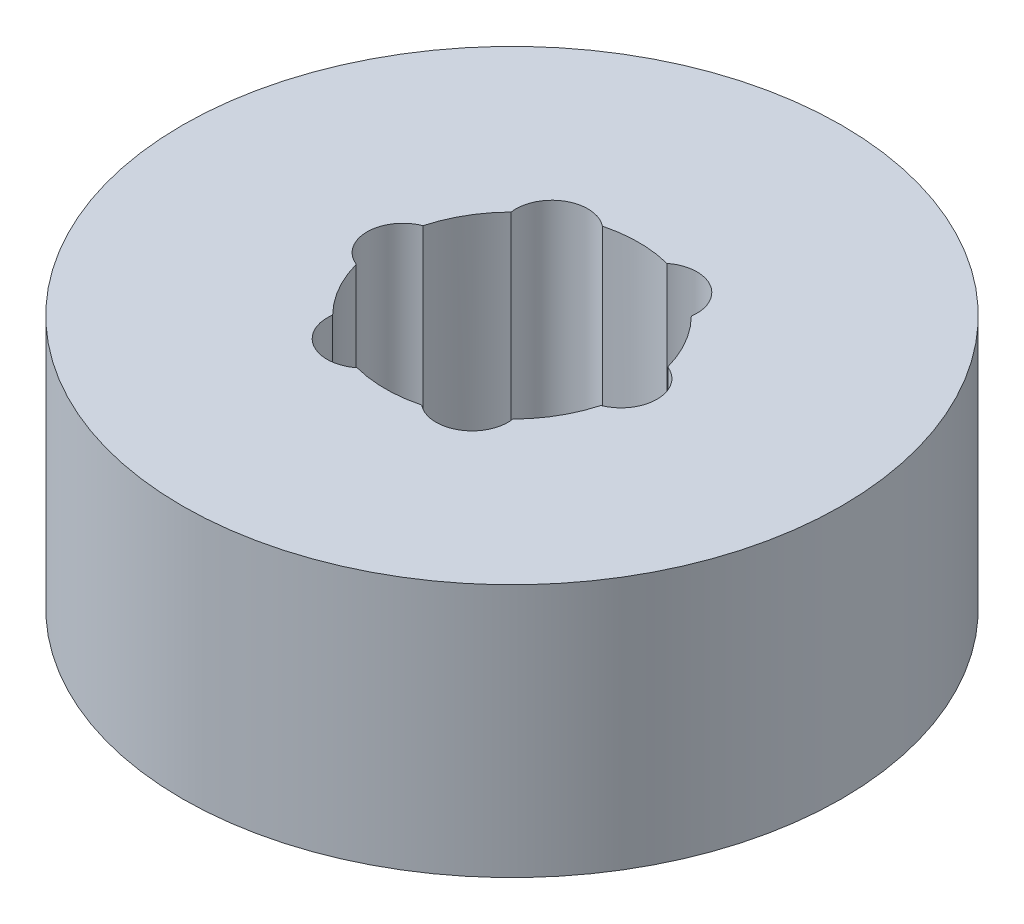
ISO-10303-21;
HEADER;
FILE_DESCRIPTION(('STEP AP214'),'2;1');
FILE_NAME('part.step','',(''),(''),'','','');
FILE_SCHEMA(('AUTOMOTIVE_DESIGN { 1 0 10303 214 1 1 1 1 }'));
ENDSEC;
DATA;
#1=APPLICATION_CONTEXT('core data for automotive mechanical design processes');
#2=APPLICATION_PROTOCOL_DEFINITION('international standard','automotive_design',2000,#1);
#3=PRODUCT_CONTEXT('',#1,'mechanical');
#4=PRODUCT('Part','Part','',(#3));
#5=PRODUCT_RELATED_PRODUCT_CATEGORY('part','',(#4));
#6=PRODUCT_DEFINITION_FORMATION('','',#4);
#7=PRODUCT_DEFINITION_CONTEXT('part definition',#1,'design');
#8=PRODUCT_DEFINITION('design','',#6,#7);
#9=PRODUCT_DEFINITION_SHAPE('','',#8);
#10=(LENGTH_UNIT() NAMED_UNIT(*) SI_UNIT(.MILLI.,.METRE.));
#11=(NAMED_UNIT(*) PLANE_ANGLE_UNIT() SI_UNIT($,.RADIAN.));
#12=(NAMED_UNIT(*) SI_UNIT($,.STERADIAN.) SOLID_ANGLE_UNIT());
#13=UNCERTAINTY_MEASURE_WITH_UNIT(LENGTH_MEASURE(1.E-05),#10,'distance_accuracy_value','');
#14=(GEOMETRIC_REPRESENTATION_CONTEXT(3) GLOBAL_UNCERTAINTY_ASSIGNED_CONTEXT((#13)) GLOBAL_UNIT_ASSIGNED_CONTEXT((#10,
#11,#12)) REPRESENTATION_CONTEXT('',''));
#15=CARTESIAN_POINT('',(0.,0.,0.));
#16=DIRECTION('',(0.,0.,1.));
#17=DIRECTION('',(1.,0.,0.));
#18=AXIS2_PLACEMENT_3D('',#15,#16,#17);
#19=CARTESIAN_POINT('',(0.,25.,0.));
#20=DIRECTION('',(0.,-1.,0.));
#21=DIRECTION('',(0.,0.,-1.));
#22=AXIS2_PLACEMENT_3D('',#19,#20,#21);
#23=CYLINDRICAL_SURFACE('',#22,32.5);
#24=CARTESIAN_POINT('',(0.,25.,0.));
#25=DIRECTION('',(0.,1.,0.));
#26=DIRECTION('',(0.,0.,1.));
#27=AXIS2_PLACEMENT_3D('',#24,#25,#26);
#28=CIRCLE('',#27,32.5);
#29=CARTESIAN_POINT('',(0.,25.,32.5));
#30=VERTEX_POINT('',#29);
#31=EDGE_CURVE('E162',#30,#30,#28,.T.);
#32=ORIENTED_EDGE('',*,*,#31,.F.);
#33=EDGE_LOOP('',(#32));
#34=FACE_BOUND('',#33,.T.);
#35=CARTESIAN_POINT('',(0.,0.,0.));
#36=DIRECTION('',(0.,1.,0.));
#37=DIRECTION('',(0.,0.,1.));
#38=AXIS2_PLACEMENT_3D('',#35,#36,#37);
#39=CIRCLE('',#38,32.5);
#40=CARTESIAN_POINT('',(0.,0.,32.5));
#41=VERTEX_POINT('',#40);
#42=EDGE_CURVE('E157',#41,#41,#39,.T.);
#43=ORIENTED_EDGE('',*,*,#42,.T.);
#44=EDGE_LOOP('',(#43));
#45=FACE_BOUND('',#44,.T.);
#46=ADVANCED_FACE('F39',(#34,#45),#23,.T.);
#47=CARTESIAN_POINT('',(0.,25.,0.));
#48=DIRECTION('',(0.,1.,0.));
#49=DIRECTION('',(0.,0.,1.));
#50=AXIS2_PLACEMENT_3D('',#47,#48,#49);
#51=PLANE('',#50);
#52=CARTESIAN_POINT('',(-5.37489814532669,25.,-9.3095966732133));
#53=DIRECTION('',(0.,1.,0.));
#54=DIRECTION('',(-0.866025403784433,0.,0.50000000000001));
#55=AXIS2_PLACEMENT_3D('',#52,#53,#54);
#56=CIRCLE('',#55,3.54547337180228);
#57=CARTESIAN_POINT('',(-3.17501813949648,25.,-12.0900479657389));
#58=VERTEX_POINT('',#57);
#59=CARTESIAN_POINT('',(-8.88277960155427,25.,-8.79467034914961));
#60=VERTEX_POINT('',#59);
#61=EDGE_CURVE('E218',#58,#60,#56,.T.);
#62=ORIENTED_EDGE('',*,*,#61,.F.);
#63=CARTESIAN_POINT('',(0.,25.,0.));
#64=DIRECTION('',(0.,1.,0.));
#65=DIRECTION('',(0.,0.,1.));
#66=AXIS2_PLACEMENT_3D('',#63,#64,#65);
#67=CIRCLE('',#66,12.5);
#68=CARTESIAN_POINT('',(3.17501813949622,25.,-12.090047965739));
#69=VERTEX_POINT('',#68);
#70=EDGE_CURVE('E169',#69,#58,#67,.T.);
#71=ORIENTED_EDGE('',*,*,#70,.F.);
#72=CARTESIAN_POINT('',(5.37489814532649,25.,-9.30959667321341));
#73=DIRECTION('',(0.,1.,0.));
#74=DIRECTION('',(-0.866025403784443,0.,-0.499999999999992));
#75=AXIS2_PLACEMENT_3D('',#72,#73,#74);
#76=CIRCLE('',#75,3.54547337180228);
#77=CARTESIAN_POINT('',(8.88277960155408,25.,-8.7946703491498));
#78=VERTEX_POINT('',#77);
#79=EDGE_CURVE('E285',#78,#69,#76,.T.);
#80=ORIENTED_EDGE('',*,*,#79,.F.);
#81=CARTESIAN_POINT('',(12.0577977410505,25.,-3.29537761658926));
#82=VERTEX_POINT('',#81);
#83=EDGE_CURVE('E174',#82,#78,#67,.T.);
#84=ORIENTED_EDGE('',*,*,#83,.F.);
#85=CARTESIAN_POINT('',(10.7497962906532,25.,0.));
#86=DIRECTION('',(0.,1.,0.));
#87=DIRECTION('',(0.,0.,-1.));
#88=AXIS2_PLACEMENT_3D('',#85,#86,#87);
#89=CIRCLE('',#88,3.54547337180228);
#90=CARTESIAN_POINT('',(12.0577977410505,25.,3.29537761658926));
#91=VERTEX_POINT('',#90);
#92=EDGE_CURVE('E280',#91,#82,#89,.T.);
#93=ORIENTED_EDGE('',*,*,#92,.F.);
#94=CARTESIAN_POINT('',(8.88277960155421,25.,8.79467034914968));
#95=VERTEX_POINT('',#94);
#96=EDGE_CURVE('E164',#95,#91,#67,.T.);
#97=ORIENTED_EDGE('',*,*,#96,.F.);
#98=CARTESIAN_POINT('',(5.37489814532662,25.,9.30959667321334));
#99=DIRECTION('',(0.,1.,0.));
#100=DIRECTION('',(0.866025403784436,0.,-0.500000000000004));
#101=AXIS2_PLACEMENT_3D('',#98,#99,#100);
#102=CIRCLE('',#101,3.54547337180228);
#103=CARTESIAN_POINT('',(3.17501813949639,25.,12.090047965739));
#104=VERTEX_POINT('',#103);
#105=EDGE_CURVE('E269',#104,#95,#102,.T.);
#106=ORIENTED_EDGE('',*,*,#105,.F.);
#107=CARTESIAN_POINT('',(-3.17501813949631,25.,12.090047965739));
#108=VERTEX_POINT('',#107);
#109=EDGE_CURVE('E149',#108,#104,#67,.T.);
#110=ORIENTED_EDGE('',*,*,#109,.F.);
#111=CARTESIAN_POINT('',(-5.37489814532656,25.,9.30959667321337));
#112=DIRECTION('',(0.,1.,0.));
#113=DIRECTION('',(0.86602540378444,0.,0.499999999999998));
#114=AXIS2_PLACEMENT_3D('',#111,#112,#113);
#115=CIRCLE('',#114,3.54547337180228);
#116=CARTESIAN_POINT('',(-8.88277960155414,25.,8.79467034914974));
#117=VERTEX_POINT('',#116);
#118=EDGE_CURVE('E128',#117,#108,#115,.T.);
#119=ORIENTED_EDGE('',*,*,#118,.F.);
#120=CARTESIAN_POINT('',(-12.0577977410505,25.,3.29537761658926));
#121=VERTEX_POINT('',#120);
#122=EDGE_CURVE('E148',#121,#117,#67,.T.);
#123=ORIENTED_EDGE('',*,*,#122,.F.);
#124=CARTESIAN_POINT('',(-10.7497962906532,25.,0.));
#125=DIRECTION('',(0.,1.,0.));
#126=DIRECTION('',(0.,0.,1.));
#127=AXIS2_PLACEMENT_3D('',#124,#125,#126);
#128=CIRCLE('',#127,3.54547337180228);
#129=CARTESIAN_POINT('',(-12.0577977410505,25.,-3.29537761658926));
#130=VERTEX_POINT('',#129);
#131=EDGE_CURVE('E179',#130,#121,#128,.T.);
#132=ORIENTED_EDGE('',*,*,#131,.F.);
#133=EDGE_CURVE('E161',#60,#130,#67,.T.);
#134=ORIENTED_EDGE('',*,*,#133,.F.);
#135=EDGE_LOOP('',(#62,#71,#80,#84,#93,#97,#106,#110,#119,#123,#132,#134));
#136=FACE_BOUND('',#135,.T.);
#137=ORIENTED_EDGE('',*,*,#31,.T.);
#138=EDGE_LOOP('',(#137));
#139=FACE_BOUND('',#138,.T.);
#140=ADVANCED_FACE('F141',(#136,#139),#51,.T.);
#141=CARTESIAN_POINT('',(0.,0.,0.));
#142=DIRECTION('',(0.,1.,0.));
#143=DIRECTION('',(0.,0.,1.));
#144=AXIS2_PLACEMENT_3D('',#141,#142,#143);
#145=PLANE('',#144);
#146=CARTESIAN_POINT('',(0.,0.,0.));
#147=DIRECTION('',(0.,1.,0.));
#148=DIRECTION('',(0.,0.,1.));
#149=AXIS2_PLACEMENT_3D('',#146,#147,#148);
#150=CIRCLE('',#149,12.5);
#151=CARTESIAN_POINT('',(0.,0.,12.5));
#152=VERTEX_POINT('',#151);
#153=EDGE_CURVE('E166',#152,#152,#150,.T.);
#154=ORIENTED_EDGE('',*,*,#153,.T.);
#155=EDGE_LOOP('',(#154));
#156=FACE_BOUND('',#155,.T.);
#157=ORIENTED_EDGE('',*,*,#42,.F.);
#158=EDGE_LOOP('',(#157));
#159=FACE_BOUND('',#158,.T.);
#160=ADVANCED_FACE('F234',(#156,#159),#145,.F.);
#161=CARTESIAN_POINT('',(0.,25.,0.));
#162=DIRECTION('',(0.,-1.,0.));
#163=DIRECTION('',(0.,0.,-1.));
#164=AXIS2_PLACEMENT_3D('',#161,#162,#163);
#165=CYLINDRICAL_SURFACE('',#164,12.5);
#166=DIRECTION('',(0.,1.,0.));
#167=VECTOR('',#166,1.);
#168=CARTESIAN_POINT('',(-3.17501813949647,15.3963991362043,-12.0900479657389));
#169=LINE('',#168,#167);
#170=CARTESIAN_POINT('',(-3.17501813949648,5.79279827240867,-12.0900479657389));
#171=VERTEX_POINT('',#170);
#172=EDGE_CURVE('E11',#171,#58,#169,.T.);
#173=ORIENTED_EDGE('',*,*,#172,.F.);
#174=CARTESIAN_POINT('',(0.,5.79279827240867,0.));
#175=DIRECTION('',(0.,1.,0.));
#176=DIRECTION('',(0.,0.,1.));
#177=AXIS2_PLACEMENT_3D('',#174,#175,#176);
#178=CIRCLE('',#177,12.5);
#179=CARTESIAN_POINT('',(-8.88277960155427,5.79279827240867,-8.79467034914961));
#180=VERTEX_POINT('',#179);
#181=EDGE_CURVE('E214',#171,#180,#178,.T.);
#182=ORIENTED_EDGE('',*,*,#181,.T.);
#183=DIRECTION('',(0.,1.,0.));
#184=VECTOR('',#183,1.);
#185=CARTESIAN_POINT('',(-8.88277960155427,15.3963991362043,-8.79467034914961));
#186=LINE('',#185,#184);
#187=EDGE_CURVE('E46',#60,#180,#186,.F.);
#188=ORIENTED_EDGE('',*,*,#187,.F.);
#189=ORIENTED_EDGE('',*,*,#133,.T.);
#190=DIRECTION('',(0.,1.,0.));
#191=VECTOR('',#190,1.);
#192=CARTESIAN_POINT('',(-12.0577977410505,15.3963991362043,-3.29537761658926));
#193=LINE('',#192,#191);
#194=CARTESIAN_POINT('',(-12.0577977410505,5.79279827240867,-3.29537761658926));
#195=VERTEX_POINT('',#194);
#196=EDGE_CURVE('E187',#195,#130,#193,.T.);
#197=ORIENTED_EDGE('',*,*,#196,.F.);
#198=CARTESIAN_POINT('',(0.,5.79279827240867,0.));
#199=DIRECTION('',(0.,1.,0.));
#200=DIRECTION('',(0.,0.,1.));
#201=AXIS2_PLACEMENT_3D('',#198,#199,#200);
#202=CIRCLE('',#201,12.5);
#203=CARTESIAN_POINT('',(-12.0577977410505,5.79279827240867,3.29537761658926));
#204=VERTEX_POINT('',#203);
#205=EDGE_CURVE('E184',#195,#204,#202,.T.);
#206=ORIENTED_EDGE('',*,*,#205,.T.);
#207=DIRECTION('',(0.,1.,0.));
#208=VECTOR('',#207,1.);
#209=CARTESIAN_POINT('',(-12.0577977410505,15.3963991362043,3.29537761658926));
#210=LINE('',#209,#208);
#211=EDGE_CURVE('E158',#121,#204,#210,.F.);
#212=ORIENTED_EDGE('',*,*,#211,.F.);
#213=ORIENTED_EDGE('',*,*,#122,.T.);
#214=DIRECTION('',(0.,1.,0.));
#215=VECTOR('',#214,1.);
#216=CARTESIAN_POINT('',(-8.88277960155414,15.3963991362043,8.79467034914974));
#217=LINE('',#216,#215);
#218=CARTESIAN_POINT('',(-8.88277960155414,5.79279827240867,8.79467034914974));
#219=VERTEX_POINT('',#218);
#220=EDGE_CURVE('E127',#219,#117,#217,.T.);
#221=ORIENTED_EDGE('',*,*,#220,.F.);
#222=CARTESIAN_POINT('',(0.,5.79279827240867,0.));
#223=DIRECTION('',(0.,1.,0.));
#224=DIRECTION('',(0.,0.,1.));
#225=AXIS2_PLACEMENT_3D('',#222,#223,#224);
#226=CIRCLE('',#225,12.5);
#227=CARTESIAN_POINT('',(-3.17501813949631,5.79279827240867,12.090047965739));
#228=VERTEX_POINT('',#227);
#229=EDGE_CURVE('E189',#219,#228,#226,.T.);
#230=ORIENTED_EDGE('',*,*,#229,.T.);
#231=DIRECTION('',(0.,1.,0.));
#232=VECTOR('',#231,1.);
#233=CARTESIAN_POINT('',(-3.1750181394963,15.3963991362043,12.090047965739));
#234=LINE('',#233,#232);
#235=EDGE_CURVE('E140',#108,#228,#234,.F.);
#236=ORIENTED_EDGE('',*,*,#235,.F.);
#237=ORIENTED_EDGE('',*,*,#109,.T.);
#238=DIRECTION('',(0.,1.,0.));
#239=VECTOR('',#238,1.);
#240=CARTESIAN_POINT('',(3.17501813949639,15.3963991362043,12.090047965739));
#241=LINE('',#240,#239);
#242=CARTESIAN_POINT('',(3.17501813949639,5.79279827240867,12.090047965739));
#243=VERTEX_POINT('',#242);
#244=EDGE_CURVE('E196',#243,#104,#241,.T.);
#245=ORIENTED_EDGE('',*,*,#244,.F.);
#246=CARTESIAN_POINT('',(0.,5.79279827240867,0.));
#247=DIRECTION('',(0.,1.,0.));
#248=DIRECTION('',(0.,0.,1.));
#249=AXIS2_PLACEMENT_3D('',#246,#247,#248);
#250=CIRCLE('',#249,12.5);
#251=CARTESIAN_POINT('',(8.88277960155421,5.79279827240867,8.79467034914968));
#252=VERTEX_POINT('',#251);
#253=EDGE_CURVE('E136',#243,#252,#250,.T.);
#254=ORIENTED_EDGE('',*,*,#253,.T.);
#255=DIRECTION('',(0.,1.,0.));
#256=VECTOR('',#255,1.);
#257=CARTESIAN_POINT('',(8.8827796015542,15.3963991362043,8.79467034914967));
#258=LINE('',#257,#256);
#259=EDGE_CURVE('E194',#95,#252,#258,.F.);
#260=ORIENTED_EDGE('',*,*,#259,.F.);
#261=ORIENTED_EDGE('',*,*,#96,.T.);
#262=DIRECTION('',(0.,1.,0.));
#263=VECTOR('',#262,1.);
#264=CARTESIAN_POINT('',(12.0577977410505,15.3963991362043,3.29537761658926));
#265=LINE('',#264,#263);
#266=CARTESIAN_POINT('',(12.0577977410505,5.79279827240867,3.29537761658926));
#267=VERTEX_POINT('',#266);
#268=EDGE_CURVE('E206',#267,#91,#265,.T.);
#269=ORIENTED_EDGE('',*,*,#268,.F.);
#270=CARTESIAN_POINT('',(0.,5.79279827240867,0.));
#271=DIRECTION('',(0.,1.,0.));
#272=DIRECTION('',(0.,0.,1.));
#273=AXIS2_PLACEMENT_3D('',#270,#271,#272);
#274=CIRCLE('',#273,12.5);
#275=CARTESIAN_POINT('',(12.0577977410505,5.79279827240867,-3.29537761658926));
#276=VERTEX_POINT('',#275);
#277=EDGE_CURVE('E199',#267,#276,#274,.T.);
#278=ORIENTED_EDGE('',*,*,#277,.T.);
#279=DIRECTION('',(0.,1.,0.));
#280=VECTOR('',#279,1.);
#281=CARTESIAN_POINT('',(12.0577977410505,15.3963991362043,-3.29537761658926));
#282=LINE('',#281,#280);
#283=EDGE_CURVE('E201',#82,#276,#282,.F.);
#284=ORIENTED_EDGE('',*,*,#283,.F.);
#285=ORIENTED_EDGE('',*,*,#83,.T.);
#286=DIRECTION('',(0.,1.,0.));
#287=VECTOR('',#286,1.);
#288=CARTESIAN_POINT('',(8.88277960155408,15.3963991362043,-8.7946703491498));
#289=LINE('',#288,#287);
#290=CARTESIAN_POINT('',(8.88277960155408,5.79279827240867,-8.7946703491498));
#291=VERTEX_POINT('',#290);
#292=EDGE_CURVE('E213',#291,#78,#289,.T.);
#293=ORIENTED_EDGE('',*,*,#292,.F.);
#294=CARTESIAN_POINT('',(0.,5.79279827240867,0.));
#295=DIRECTION('',(0.,1.,0.));
#296=DIRECTION('',(0.,0.,1.));
#297=AXIS2_PLACEMENT_3D('',#294,#295,#296);
#298=CIRCLE('',#297,12.5);
#299=CARTESIAN_POINT('',(3.17501813949622,5.79279827240867,-12.090047965739));
#300=VERTEX_POINT('',#299);
#301=EDGE_CURVE('E208',#291,#300,#298,.T.);
#302=ORIENTED_EDGE('',*,*,#301,.T.);
#303=DIRECTION('',(0.,1.,0.));
#304=VECTOR('',#303,1.);
#305=CARTESIAN_POINT('',(3.17501813949622,15.3963991362043,-12.090047965739));
#306=LINE('',#305,#304);
#307=EDGE_CURVE('E211',#69,#300,#306,.F.);
#308=ORIENTED_EDGE('',*,*,#307,.F.);
#309=ORIENTED_EDGE('',*,*,#70,.T.);
#310=EDGE_LOOP('',(#173,#182,#188,#189,#197,#206,#212,#213,#221,#230,#236,#237,#245,#254,#260,
#261,#269,#278,#284,#285,#293,#302,#308,#309));
#311=FACE_BOUND('',#310,.T.);
#312=ORIENTED_EDGE('',*,*,#153,.F.);
#313=EDGE_LOOP('',(#312));
#314=FACE_BOUND('',#313,.T.);
#315=ADVANCED_FACE('F152',(#311,#314),#165,.F.);
#316=CARTESIAN_POINT('',(-10.7497962906532,5.79279827240867,0.));
#317=DIRECTION('',(0.,1.,0.));
#318=DIRECTION('',(0.,0.,1.));
#319=AXIS2_PLACEMENT_3D('',#316,#317,#318);
#320=CYLINDRICAL_SURFACE('',#319,3.54547337180228);
#321=ORIENTED_EDGE('',*,*,#196,.T.);
#322=ORIENTED_EDGE('',*,*,#131,.T.);
#323=ORIENTED_EDGE('',*,*,#211,.T.);
#324=CARTESIAN_POINT('',(-10.7497962906532,5.79279827240867,0.));
#325=DIRECTION('',(0.,1.,0.));
#326=DIRECTION('',(0.,0.,1.));
#327=AXIS2_PLACEMENT_3D('',#324,#325,#326);
#328=CIRCLE('',#327,3.54547337180228);
#329=EDGE_CURVE('E180',#195,#204,#328,.T.);
#330=ORIENTED_EDGE('',*,*,#329,.F.);
#331=EDGE_LOOP('',(#321,#322,#323,#330));
#332=FACE_BOUND('',#331,.T.);
#333=ADVANCED_FACE('F244',(#332),#320,.F.);
#334=CARTESIAN_POINT('',(-10.7497962906532,5.79279827240867,0.));
#335=DIRECTION('',(0.,1.,0.));
#336=DIRECTION('',(0.,0.,1.));
#337=AXIS2_PLACEMENT_3D('',#334,#335,#336);
#338=PLANE('',#337);
#339=ORIENTED_EDGE('',*,*,#329,.T.);
#340=ORIENTED_EDGE('',*,*,#205,.F.);
#341=EDGE_LOOP('',(#339,#340));
#342=FACE_BOUND('',#341,.T.);
#343=ADVANCED_FACE('F248',(#342),#338,.T.);
#344=CARTESIAN_POINT('',(-5.37489814532656,5.79279827240867,9.30959667321337));
#345=DIRECTION('',(0.,1.,0.));
#346=DIRECTION('',(0.,0.,1.));
#347=AXIS2_PLACEMENT_3D('',#344,#345,#346);
#348=CYLINDRICAL_SURFACE('',#347,3.54547337180228);
#349=ORIENTED_EDGE('',*,*,#220,.T.);
#350=ORIENTED_EDGE('',*,*,#118,.T.);
#351=ORIENTED_EDGE('',*,*,#235,.T.);
#352=CARTESIAN_POINT('',(-5.37489814532656,5.79279827240867,9.30959667321337));
#353=DIRECTION('',(0.,1.,0.));
#354=DIRECTION('',(0.86602540378444,0.,0.499999999999998));
#355=AXIS2_PLACEMENT_3D('',#352,#353,#354);
#356=CIRCLE('',#355,3.54547337180228);
#357=EDGE_CURVE('E135',#219,#228,#356,.T.);
#358=ORIENTED_EDGE('',*,*,#357,.F.);
#359=EDGE_LOOP('',(#349,#350,#351,#358));
#360=FACE_BOUND('',#359,.T.);
#361=ADVANCED_FACE('F126',(#360),#348,.F.);
#362=CARTESIAN_POINT('',(-5.37489814532656,5.79279827240867,9.30959667321337));
#363=DIRECTION('',(0.,1.,0.));
#364=DIRECTION('',(0.86602540378444,0.,0.499999999999998));
#365=AXIS2_PLACEMENT_3D('',#362,#363,#364);
#366=PLANE('',#365);
#367=ORIENTED_EDGE('',*,*,#357,.T.);
#368=ORIENTED_EDGE('',*,*,#229,.F.);
#369=EDGE_LOOP('',(#367,#368));
#370=FACE_BOUND('',#369,.T.);
#371=ADVANCED_FACE('F258',(#370),#366,.T.);
#372=CARTESIAN_POINT('',(5.37489814532662,5.79279827240867,9.30959667321334));
#373=DIRECTION('',(0.,1.,0.));
#374=DIRECTION('',(0.,0.,1.));
#375=AXIS2_PLACEMENT_3D('',#372,#373,#374);
#376=CYLINDRICAL_SURFACE('',#375,3.54547337180228);
#377=ORIENTED_EDGE('',*,*,#244,.T.);
#378=ORIENTED_EDGE('',*,*,#105,.T.);
#379=ORIENTED_EDGE('',*,*,#259,.T.);
#380=CARTESIAN_POINT('',(5.37489814532662,5.79279827240867,9.30959667321334));
#381=DIRECTION('',(0.,1.,0.));
#382=DIRECTION('',(0.866025403784436,0.,-0.500000000000004));
#383=AXIS2_PLACEMENT_3D('',#380,#381,#382);
#384=CIRCLE('',#383,3.54547337180228);
#385=EDGE_CURVE('E147',#243,#252,#384,.T.);
#386=ORIENTED_EDGE('',*,*,#385,.F.);
#387=EDGE_LOOP('',(#377,#378,#379,#386));
#388=FACE_BOUND('',#387,.T.);
#389=ADVANCED_FACE('F256',(#388),#376,.F.);
#390=CARTESIAN_POINT('',(5.37489814532662,5.79279827240867,9.30959667321334));
#391=DIRECTION('',(0.,1.,0.));
#392=DIRECTION('',(0.866025403784436,0.,-0.500000000000004));
#393=AXIS2_PLACEMENT_3D('',#390,#391,#392);
#394=PLANE('',#393);
#395=ORIENTED_EDGE('',*,*,#385,.T.);
#396=ORIENTED_EDGE('',*,*,#253,.F.);
#397=EDGE_LOOP('',(#395,#396));
#398=FACE_BOUND('',#397,.T.);
#399=ADVANCED_FACE('F263',(#398),#394,.T.);
#400=CARTESIAN_POINT('',(10.7497962906532,5.79279827240867,0.));
#401=DIRECTION('',(0.,1.,0.));
#402=DIRECTION('',(0.,0.,1.));
#403=AXIS2_PLACEMENT_3D('',#400,#401,#402);
#404=CYLINDRICAL_SURFACE('',#403,3.54547337180228);
#405=ORIENTED_EDGE('',*,*,#268,.T.);
#406=ORIENTED_EDGE('',*,*,#92,.T.);
#407=ORIENTED_EDGE('',*,*,#283,.T.);
#408=CARTESIAN_POINT('',(10.7497962906532,5.79279827240867,0.));
#409=DIRECTION('',(0.,1.,0.));
#410=DIRECTION('',(0.,0.,-1.));
#411=AXIS2_PLACEMENT_3D('',#408,#409,#410);
#412=CIRCLE('',#411,3.54547337180228);
#413=EDGE_CURVE('E273',#267,#276,#412,.T.);
#414=ORIENTED_EDGE('',*,*,#413,.F.);
#415=EDGE_LOOP('',(#405,#406,#407,#414));
#416=FACE_BOUND('',#415,.T.);
#417=ADVANCED_FACE('F297',(#416),#404,.F.);
#418=CARTESIAN_POINT('',(10.7497962906532,5.79279827240867,0.));
#419=DIRECTION('',(0.,1.,0.));
#420=DIRECTION('',(0.,0.,-1.));
#421=AXIS2_PLACEMENT_3D('',#418,#419,#420);
#422=PLANE('',#421);
#423=ORIENTED_EDGE('',*,*,#413,.T.);
#424=ORIENTED_EDGE('',*,*,#277,.F.);
#425=EDGE_LOOP('',(#423,#424));
#426=FACE_BOUND('',#425,.T.);
#427=ADVANCED_FACE('F299',(#426),#422,.T.);
#428=CARTESIAN_POINT('',(5.37489814532649,5.79279827240867,-9.30959667321341));
#429=DIRECTION('',(0.,1.,0.));
#430=DIRECTION('',(0.,0.,1.));
#431=AXIS2_PLACEMENT_3D('',#428,#429,#430);
#432=CYLINDRICAL_SURFACE('',#431,3.54547337180228);
#433=ORIENTED_EDGE('',*,*,#292,.T.);
#434=ORIENTED_EDGE('',*,*,#79,.T.);
#435=ORIENTED_EDGE('',*,*,#307,.T.);
#436=CARTESIAN_POINT('',(5.37489814532649,5.79279827240867,-9.30959667321341));
#437=DIRECTION('',(0.,1.,0.));
#438=DIRECTION('',(-0.866025403784443,0.,-0.499999999999992));
#439=AXIS2_PLACEMENT_3D('',#436,#437,#438);
#440=CIRCLE('',#439,3.54547337180228);
#441=EDGE_CURVE('E56',#291,#300,#440,.T.);
#442=ORIENTED_EDGE('',*,*,#441,.F.);
#443=EDGE_LOOP('',(#433,#434,#435,#442));
#444=FACE_BOUND('',#443,.T.);
#445=ADVANCED_FACE('F292',(#444),#432,.F.);
#446=CARTESIAN_POINT('',(5.37489814532649,5.79279827240867,-9.30959667321341));
#447=DIRECTION('',(0.,1.,0.));
#448=DIRECTION('',(-0.866025403784443,0.,-0.499999999999992));
#449=AXIS2_PLACEMENT_3D('',#446,#447,#448);
#450=PLANE('',#449);
#451=ORIENTED_EDGE('',*,*,#441,.T.);
#452=ORIENTED_EDGE('',*,*,#301,.F.);
#453=EDGE_LOOP('',(#451,#452));
#454=FACE_BOUND('',#453,.T.);
#455=ADVANCED_FACE('F226',(#454),#450,.T.);
#456=CARTESIAN_POINT('',(-5.37489814532669,5.79279827240867,-9.3095966732133));
#457=DIRECTION('',(0.,1.,0.));
#458=DIRECTION('',(0.,0.,1.));
#459=AXIS2_PLACEMENT_3D('',#456,#457,#458);
#460=CYLINDRICAL_SURFACE('',#459,3.54547337180228);
#461=ORIENTED_EDGE('',*,*,#172,.T.);
#462=ORIENTED_EDGE('',*,*,#61,.T.);
#463=ORIENTED_EDGE('',*,*,#187,.T.);
#464=CARTESIAN_POINT('',(-5.37489814532669,5.79279827240867,-9.3095966732133));
#465=DIRECTION('',(0.,1.,0.));
#466=DIRECTION('',(-0.866025403784433,0.,0.50000000000001));
#467=AXIS2_PLACEMENT_3D('',#464,#465,#466);
#468=CIRCLE('',#467,3.54547337180228);
#469=EDGE_CURVE('E55',#171,#180,#468,.T.);
#470=ORIENTED_EDGE('',*,*,#469,.F.);
#471=EDGE_LOOP('',(#461,#462,#463,#470));
#472=FACE_BOUND('',#471,.T.);
#473=ADVANCED_FACE('F217',(#472),#460,.F.);
#474=CARTESIAN_POINT('',(-5.37489814532669,5.79279827240867,-9.3095966732133));
#475=DIRECTION('',(0.,1.,0.));
#476=DIRECTION('',(-0.866025403784433,0.,0.50000000000001));
#477=AXIS2_PLACEMENT_3D('',#474,#475,#476);
#478=PLANE('',#477);
#479=ORIENTED_EDGE('',*,*,#469,.T.);
#480=ORIENTED_EDGE('',*,*,#181,.F.);
#481=EDGE_LOOP('',(#479,#480));
#482=FACE_BOUND('',#481,.T.);
#483=ADVANCED_FACE('F219',(#482),#478,.T.);
#484=CLOSED_SHELL('',(#46,#140,#160,#315,#333,#343,#361,#371,#389,#399,#417,#427,#445,#455,#473,#483));
#485=MANIFOLD_SOLID_BREP('B2',#484);
#486=ADVANCED_BREP_SHAPE_REPRESENTATION('',(#18,#485),#14);
#487=SHAPE_DEFINITION_REPRESENTATION(#9,#486);
ENDSEC;
END-ISO-10303-21;
